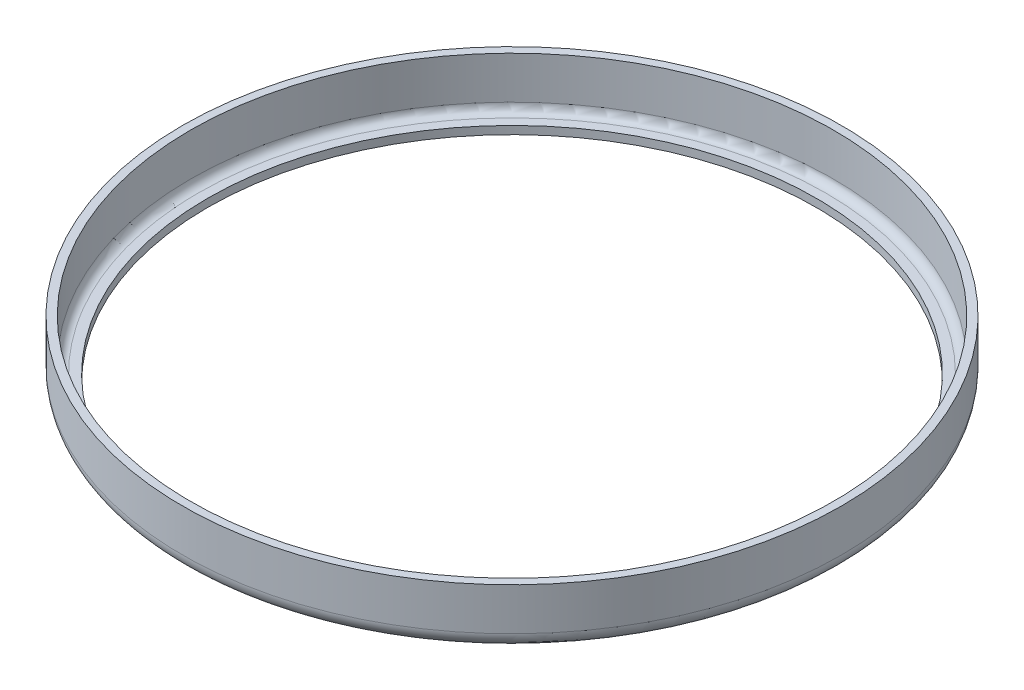
ISO-10303-21;
HEADER;
FILE_DESCRIPTION(('STEP AP214'),'2;1');
FILE_NAME('part.step','',(''),(''),'','','');
FILE_SCHEMA(('AUTOMOTIVE_DESIGN { 1 0 10303 214 1 1 1 1 }'));
ENDSEC;
DATA;
#1=APPLICATION_CONTEXT('core data for automotive mechanical design processes');
#2=APPLICATION_PROTOCOL_DEFINITION('international standard','automotive_design',2000,#1);
#3=PRODUCT_CONTEXT('',#1,'mechanical');
#4=PRODUCT('Part','Part','',(#3));
#5=PRODUCT_RELATED_PRODUCT_CATEGORY('part','',(#4));
#6=PRODUCT_DEFINITION_FORMATION('','',#4);
#7=PRODUCT_DEFINITION_CONTEXT('part definition',#1,'design');
#8=PRODUCT_DEFINITION('design','',#6,#7);
#9=PRODUCT_DEFINITION_SHAPE('','',#8);
#10=(LENGTH_UNIT() NAMED_UNIT(*) SI_UNIT(.MILLI.,.METRE.));
#11=(NAMED_UNIT(*) PLANE_ANGLE_UNIT() SI_UNIT($,.RADIAN.));
#12=(NAMED_UNIT(*) SI_UNIT($,.STERADIAN.) SOLID_ANGLE_UNIT());
#13=UNCERTAINTY_MEASURE_WITH_UNIT(LENGTH_MEASURE(1.E-05),#10,'distance_accuracy_value','');
#14=(GEOMETRIC_REPRESENTATION_CONTEXT(3) GLOBAL_UNCERTAINTY_ASSIGNED_CONTEXT((#13)) GLOBAL_UNIT_ASSIGNED_CONTEXT((#10,
#11,#12)) REPRESENTATION_CONTEXT('',''));
#15=CARTESIAN_POINT('',(0.,0.,0.));
#16=DIRECTION('',(0.,0.,1.));
#17=DIRECTION('',(1.,0.,0.));
#18=AXIS2_PLACEMENT_3D('',#15,#16,#17);
#19=CARTESIAN_POINT('',(0.,1.3,0.));
#20=DIRECTION('',(0.,1.,0.));
#21=DIRECTION('',(-1.00000000000002,0.,0.));
#22=AXIS2_PLACEMENT_3D('',#19,#20,#21);
#23=PLANE('',#22);
#24=CARTESIAN_POINT('',(0.,1.3,0.));
#25=DIRECTION('',(0.,1.,0.));
#26=DIRECTION('',(-1.00000000000002,0.,0.));
#27=AXIS2_PLACEMENT_3D('',#24,#25,#26);
#28=CIRCLE('',#27,49.5);
#29=CARTESIAN_POINT('',(-49.5000000000008,1.3,0.));
#30=VERTEX_POINT('',#29);
#31=EDGE_CURVE('E52',#30,#30,#28,.F.);
#32=ORIENTED_EDGE('',*,*,#31,.T.);
#33=EDGE_LOOP('',(#32));
#34=FACE_BOUND('',#33,.T.);
#35=CARTESIAN_POINT('',(0.,1.29999999999997,0.));
#36=DIRECTION('',(0.,-1.,0.));
#37=DIRECTION('',(-1.,0.,0.));
#38=AXIS2_PLACEMENT_3D('',#35,#36,#37);
#39=CIRCLE('',#38,51.0000000000011);
#40=CARTESIAN_POINT('',(50.9999999999999,1.3,-2.77555756156289E-13));
#41=VERTEX_POINT('',#40);
#42=CARTESIAN_POINT('',(-51.0000000000025,1.30000000000094,2.77555756156289E-13));
#43=VERTEX_POINT('',#42);
#44=EDGE_CURVE('E50',#41,#43,#39,.F.);
#45=ORIENTED_EDGE('',*,*,#44,.T.);
#46=CARTESIAN_POINT('',(51.0000000000011,1.29999999999997,1.40222590497045E-12));
#47=CARTESIAN_POINT('',(51.0000048953485,1.30000000000004,0.380232623312235));
#48=CARTESIAN_POINT('',(50.9957559119841,1.30000000001966,0.760465264725513));
#49=CARTESIAN_POINT('',(50.9787540292228,1.30000000009177,1.52081383078117));
#50=CARTESIAN_POINT('',(50.9659994881611,1.30000000014425,1.90092971871636));
#51=CARTESIAN_POINT('',(50.9319870512741,1.30000000027581,2.66085438904162));
#52=CARTESIAN_POINT('',(50.9107275146435,1.30000000035489,3.04066309799429));
#53=CARTESIAN_POINT('',(50.8597110518035,1.30000000053389,3.79978301740329));
#54=CARTESIAN_POINT('',(50.8299524866904,1.30000000063381,4.17909411771774));
#55=CARTESIAN_POINT('',(50.7619478933915,1.30000000084908,4.93702848590969));
#56=CARTESIAN_POINT('',(50.7237002289666,1.30000000096443,5.3156516069787));
#57=CARTESIAN_POINT('',(50.6387317130373,1.30000000120554,6.07201984611027));
#58=CARTESIAN_POINT('',(50.5920092287955,1.3000000013313,6.44976478075572));
#59=CARTESIAN_POINT('',(50.4901095934662,1.30000000158862,7.20418673328679));
#60=CARTESIAN_POINT('',(50.4349308139587,1.30000000172017,7.58086353122263));
#61=CARTESIAN_POINT('',(50.3161413768474,1.30000000198482,8.33295964982723));
#62=CARTESIAN_POINT('',(50.2525290959609,1.30000000211791,8.70837871410802));
#63=CARTESIAN_POINT('',(50.1168997001871,1.30000000238178,9.4577702537691));
#64=CARTESIAN_POINT('',(50.0448809679707,1.30000000251256,9.83174243643603));
#65=CARTESIAN_POINT('',(49.8924699631137,1.30000000276833,10.5780516458893));
#66=CARTESIAN_POINT('',(49.8120760799122,1.30000000289332,10.9503883437681));
#67=CARTESIAN_POINT('',(49.642950305587,1.30000000313444,11.6932386569323));
#68=CARTESIAN_POINT('',(49.5542168114822,1.30000000325056,12.0637519072653));
#69=CARTESIAN_POINT('',(49.3684515747471,1.30000000347122,12.8027681343645));
#70=CARTESIAN_POINT('',(49.271418237524,1.30000000357577,13.1712707103013));
#71=CARTESIAN_POINT('',(49.0690972864774,1.30000000377097,13.9060792286356));
#72=CARTESIAN_POINT('',(48.9638080872544,1.30000000386163,14.2723847345126));
#73=CARTESIAN_POINT('',(48.7450235801936,1.30000000402713,15.0026136787654));
#74=CARTESIAN_POINT('',(48.6315266969507,1.30000000410197,15.3665366451334));
#75=CARTESIAN_POINT('',(48.3963791672686,1.30000000423429,16.0918160971216));
#76=CARTESIAN_POINT('',(48.2747269562154,1.30000000429177,16.4531720754687));
#77=CARTESIAN_POINT('',(48.0233252729985,1.30000000438821,17.1731342532382));
#78=CARTESIAN_POINT('',(47.8935742478034,1.30000000442718,17.5317399103622));
#79=CARTESIAN_POINT('',(47.6260355721532,1.30000000448581,18.2460193565318));
#80=CARTESIAN_POINT('',(47.488246381036,1.30000000450549,18.6016925685115));
#81=CARTESIAN_POINT('',(47.2046961181249,1.30000000452516,19.3099263377674));
#82=CARTESIAN_POINT('',(47.0589335188196,1.30000000452516,19.6624862834858));
#83=CARTESIAN_POINT('',(46.7595052656973,1.30000000450549,20.3643141291315));
#84=CARTESIAN_POINT('',(46.6058380982945,1.30000000448581,20.7135813833022));
#85=CARTESIAN_POINT('',(46.2906735874608,1.30000000442717,21.4086459427654));
#86=CARTESIAN_POINT('',(46.1291747451384,1.30000000438821,21.7544425684132));
#87=CARTESIAN_POINT('',(45.7984237839038,1.30000000429176,22.442389547615));
#88=CARTESIAN_POINT('',(45.6291701815562,1.30000000423428,22.784539187964));
#89=CARTESIAN_POINT('',(45.282990587211,1.30000000410196,23.4650175444538));
#90=CARTESIAN_POINT('',(45.106063127989,1.30000000402711,23.8033455141745));
#91=CARTESIAN_POINT('',(44.7446206588054,1.30000000386161,24.4760076389348));
#92=CARTESIAN_POINT('',(44.5601041985775,1.30000000377095,24.8103410147014));
#93=CARTESIAN_POINT('',(44.1835724806725,1.30000000357575,25.4748429125298));
#94=CARTESIAN_POINT('',(43.9915557904262,1.3000000034712,25.8050106228448));
#95=CARTESIAN_POINT('',(43.6001162405041,1.30000000325054,26.4610120912091));
#96=CARTESIAN_POINT('',(43.4006919666873,1.30000000313442,26.7868450054338));
#97=CARTESIAN_POINT('',(42.9945337107306,1.3000000028933,27.4340098117425));
#98=CARTESIAN_POINT('',(42.7877983336001,1.30000000276831,27.7553408283363));
#99=CARTESIAN_POINT('',(42.3671181213993,1.30000000251254,28.3933368853951));
#100=CARTESIAN_POINT('',(42.1531719112016,1.30000000238176,28.7100010191329));
#101=CARTESIAN_POINT('',(41.7181740272877,1.30000000211789,29.3385005592009));
#102=CARTESIAN_POINT('',(41.4971209990111,1.30000000198479,29.650335028012));
#103=CARTESIAN_POINT('',(41.0480171680535,1.30000000172015,30.2690147734759));
#104=CARTESIAN_POINT('',(40.8199650320725,1.30000000158861,30.5758590822779));
#105=CARTESIAN_POINT('',(40.3569743261539,1.30000000133127,31.1844004199075));
#106=CARTESIAN_POINT('',(40.1220344448613,1.30000000120547,31.4860964510302));
#107=CARTESIAN_POINT('',(39.6453831651447,1.30000000096446,32.084185583385));
#108=CARTESIAN_POINT('',(39.4036704779801,1.30000000084925,32.3805776575469));
#109=CARTESIAN_POINT('',(38.9135921135735,1.3000000006336,32.9679058297777));
#110=CARTESIAN_POINT('',(38.6652251708807,1.30000000053317,33.2588408719308));
#111=CARTESIAN_POINT('',(38.1619600513173,1.30000000035559,33.835104306793));
#112=CARTESIAN_POINT('',(37.9070606328873,1.30000000027845,34.1204316152161));
#113=CARTESIAN_POINT('',(37.3908567064002,1.30000000014159,34.685332526614));
#114=CARTESIAN_POINT('',(37.129550981498,1.30000000008187,34.9649050176454));
#115=CARTESIAN_POINT('',(36.6006603728141,1.30000000002955,35.5181485867267));
#116=CARTESIAN_POINT('',(36.333074296843,1.30000000003695,35.7918185250712));
#117=CARTESIAN_POINT('',(35.7926789600628,1.29999999996311,36.3322115838581));
#118=CARTESIAN_POINT('',(35.5198890399216,1.29999999988215,36.5989540465125));
#119=CARTESIAN_POINT('',(34.9684120981634,1.30000000047372,37.1262667336197));
#120=CARTESIAN_POINT('',(34.6897251338749,1.30000000114624,37.3868370180235));
#121=CARTESIAN_POINT('',(34.1265925188402,1.30000000828845,37.9016721321774));
#122=CARTESIAN_POINT('',(33.8421469164047,1.3000000147581,38.155937014785));
#123=CARTESIAN_POINT('',(33.2676336433649,1.30000004037257,38.6580368453367));
#124=CARTESIAN_POINT('',(32.9775660124353,1.3000000595173,38.9058718386275));
#125=CARTESIAN_POINT('',(32.5749711243775,1.30000010590587,39.2421372724515));
#126=CARTESIAN_POINT('',(32.4647878435348,1.30000012060952,39.3333857931316));
#127=CARTESIAN_POINT('',(32.1699487210441,1.30000016101672,39.5754656337397));
#128=CARTESIAN_POINT('',(31.9846107209603,1.30000018751906,39.725467462671));
#129=CARTESIAN_POINT('',(31.5000063298851,1.3000002388895,40.1120409400492));
#130=CARTESIAN_POINT('',(31.199098398841,1.30000025323811,40.3465591494801));
#131=CARTESIAN_POINT('',(30.5920664737256,1.30000024176806,40.8087194195142));
#132=CARTESIAN_POINT('',(30.2859426424971,1.30000021595065,41.0363616941741));
#133=CARTESIAN_POINT('',(29.6686522730672,1.30000013805282,41.4846861110324));
#134=CARTESIAN_POINT('',(29.3574859112218,1.30000008597332,41.7053684958519));
#135=CARTESIAN_POINT('',(28.8086070691194,1.30000002406073,42.0852713355522));
#136=CARTESIAN_POINT('',(28.5719805079036,1.30000000692072,42.2460637359961));
#137=CARTESIAN_POINT('',(28.0815311708753,1.29999999265297,42.5736224797933));
#138=CARTESIAN_POINT('',(27.8275468780447,1.2999999968228,42.7401468249885));
#139=CARTESIAN_POINT('',(27.1247071788338,1.30000000948357,43.1920099422009));
#140=CARTESIAN_POINT('',(26.6727992749548,1.30000001886738,43.4726244578467));
#141=CARTESIAN_POINT('',(25.8373755655955,1.30000005827416,43.9734668032541));
#142=CARTESIAN_POINT('',(25.4551768835139,1.30000008455003,44.1958982290036));
#143=CARTESIAN_POINT('',(24.7293748413674,1.30000012114482,44.6057025717949));
#144=CARTESIAN_POINT('',(24.3863872415915,1.30000013295123,44.7941656777227));
#145=CARTESIAN_POINT('',(23.7468980640549,1.30000013816056,45.135987168959));
#146=CARTESIAN_POINT('',(23.4509767310036,1.30000013401424,45.2904326752651));
#147=CARTESIAN_POINT('',(22.8136674692762,1.30000011905215,45.6151172218906));
#148=CARTESIAN_POINT('',(22.471822825437,1.3000001073683,45.7844610383677));
#149=CARTESIAN_POINT('',(21.7844149524749,1.30000007856826,46.1154084448794));
#150=CARTESIAN_POINT('',(21.4388517703311,1.30000006145212,46.2770121325608));
#151=CARTESIAN_POINT('',(20.7441857596187,1.30000002940438,46.5924207569258));
#152=CARTESIAN_POINT('',(20.3950829802779,1.30000001447274,46.7462258018928));
#153=CARTESIAN_POINT('',(19.8688903310311,1.3000000026321,46.970967826308));
#154=CARTESIAN_POINT('',(19.6930692936607,1.3000000004447,47.0448877405391));
#155=CARTESIAN_POINT('',(19.4441896464357,1.29999999981657,47.1479461182615));
#156=CARTESIAN_POINT('',(19.3714573778846,1.29999999992952,47.1778742777366));
#157=CARTESIAN_POINT('',(18.9682018343383,1.30000000047577,47.3427343001144));
#158=CARTESIAN_POINT('',(18.6363429869361,1.30000000062823,47.4744176352255));
#159=CARTESIAN_POINT('',(17.9298893857376,1.30000001127747,47.7461864311565));
#160=CARTESIAN_POINT('',(17.5549509911732,1.30000002301503,47.8853801998632));
#161=CARTESIAN_POINT('',(17.0491026914806,1.30000004635177,48.0664377348198));
#162=CARTESIAN_POINT('',(16.9195800040389,1.30000005298323,48.1122084582501));
#163=CARTESIAN_POINT('',(16.4135202378347,1.30000007960455,48.2887371289975));
#164=CARTESIAN_POINT('',(16.0356117392949,1.30000010101756,48.4156009943435));
#165=CARTESIAN_POINT('',(15.3731091344207,1.30000012648924,48.6293594906973));
#166=CARTESIAN_POINT('',(15.0891492296098,1.30000013357146,48.7182327370473));
#167=CARTESIAN_POINT('',(14.3937588859848,1.30000013892277,48.9291855569189));
#168=CARTESIAN_POINT('',(13.9815044236223,1.30000013190768,49.048564126554));
#169=CARTESIAN_POINT('',(13.2000828802505,1.30000011059786,49.2641649693793));
#170=CARTESIAN_POINT('',(12.8312181643626,1.30000009719865,49.361486334691));
#171=CARTESIAN_POINT('',(12.0914026404635,1.3000000660953,49.5478203829303));
#172=CARTESIAN_POINT('',(11.7204518595005,1.30000004839122,49.6368331733261));
#173=CARTESIAN_POINT('',(10.8836498443692,1.30000001560985,49.8276350984483));
#174=CARTESIAN_POINT('',(10.4172547554717,1.30000000229537,49.9270561287481));
#175=CARTESIAN_POINT('',(9.80941312730119,1.29999999931184,50.0479271274064));
#176=CARTESIAN_POINT('',(9.66910720238875,1.29999999961401,50.0752272813089));
#177=CARTESIAN_POINT('',(9.1125796454198,1.30000000119024,50.1811095335644));
#178=CARTESIAN_POINT('',(8.69547640814187,1.30000000320776,50.2551421365725));
#179=CARTESIAN_POINT('',(8.01204804977799,1.30000001931491,50.3676790460062));
#180=CARTESIAN_POINT('',(7.7462280877952,1.30000002873203,50.4092917286635));
#181=CARTESIAN_POINT('',(7.23985127965435,1.30000005090437,50.4844613212104));
#182=CARTESIAN_POINT('',(6.99935230387317,1.30000006324576,50.5184080994232));
#183=CARTESIAN_POINT('',(6.3790239643244,1.30000009473286,50.6014398619712));
#184=CARTESIAN_POINT('',(5.99884738598328,1.30000011369705,50.6479616662361));
#185=CARTESIAN_POINT('',(5.41181983913989,1.30000013093692,50.713063947147));
#186=CARTESIAN_POINT('',(5.20530082657881,1.30000013470932,50.7346856589073));
#187=CARTESIAN_POINT('',(4.85629517127097,1.30000013648816,50.7690616518893));
#188=CARTESIAN_POINT('',(4.71387388834275,1.30000013592319,50.7824820960566));
#189=CARTESIAN_POINT('',(4.19146963898793,1.30000013159213,50.829487309259));
#190=CARTESIAN_POINT('',(3.81114897425673,1.3000001240603,50.8594019566097));
#191=CARTESIAN_POINT('',(3.04994010327919,1.30000010132011,50.9106638980837));
#192=CARTESIAN_POINT('',(2.66905190388895,1.30000008611184,50.9320112948747));
#193=CARTESIAN_POINT('',(1.90689541399295,1.30000005333875,50.9661458217759));
#194=CARTESIAN_POINT('',(1.52562712859177,1.30000003577397,50.9789330653389));
#195=CARTESIAN_POINT('',(0.762905692602223,1.30000001052994,50.995881077218));
#196=CARTESIAN_POINT('',(0.381452544779176,1.30000000285054,51.0000419708189));
#197=CARTESIAN_POINT('',(-0.38150742653925,1.29999999714899,50.9999580231448));
#198=CARTESIAN_POINT('',(-0.76301424986109,1.29999999912822,50.9957119724025));
#199=CARTESIAN_POINT('',(-1.52583357766029,1.30000000122791,50.978647330572));
#200=CARTESIAN_POINT('',(-1.90714608398969,1.3000000013484,50.9658288227771));
#201=CARTESIAN_POINT('',(-2.66938441111985,1.3000000080882,50.9316714338153));
#202=CARTESIAN_POINT('',(-3.05031023513617,1.30000001470746,50.9103326240928));
#203=CARTESIAN_POINT('',(-3.81159065259312,1.30000004042723,50.8591301196195));
#204=CARTESIAN_POINT('',(-4.19194525004413,1.30000005952766,50.8292664850023));
#205=CARTESIAN_POINT('',(-4.71439839531722,1.30000010590383,50.7823643103985));
#206=CARTESIAN_POINT('',(-4.85683218805623,1.30000012060907,50.7689754416173));
#207=CARTESIAN_POINT('',(-5.23649122711368,1.30000016101751,50.7316690320357));
#208=CARTESIAN_POINT('',(-5.47361229373592,1.30000018751753,50.7066825671874));
#209=CARTESIAN_POINT('',(-6.08962807102608,1.30000023888386,50.6373642184656));
#210=CARTESIAN_POINT('',(-6.46823152510258,1.30000025323185,50.5904196039386));
#211=CARTESIAN_POINT('',(-7.22426457588278,1.30000024176133,50.4879798795678));
#212=CARTESIAN_POINT('',(-7.60169420879945,1.30000021594407,50.4324850362267));
#213=CARTESIAN_POINT('',(-8.35519765050665,1.30000013804811,50.3130080646171));
#214=CARTESIAN_POINT('',(-8.73127150615274,1.30000008597032,50.2490262326035));
#215=CARTESIAN_POINT('',(-9.38801933299508,1.30000002405986,50.1295421606239));
#216=CARTESIAN_POINT('',(-9.66903697668177,1.30000000692048,50.0759193141923));
#217=CARTESIAN_POINT('',(-10.2474564899168,1.29999999265322,49.9607381834239));
#218=CARTESIAN_POINT('',(-10.5448014491295,1.29999999682288,49.8988945628621));
#219=CARTESIAN_POINT('',(-11.3612996357026,1.30000000948343,49.7214272966985));
#220=CARTESIAN_POINT('',(-11.8792707557543,1.30000001886735,49.6003046787099));
#221=CARTESIAN_POINT('',(-12.8241529428596,1.30000005827417,49.3637200783754));
#222=CARTESIAN_POINT('',(-13.251690838201,1.30000008455,49.2507476107575));
#223=CARTESIAN_POINT('',(-14.0546858157818,1.30000012114476,49.027303502203));
#224=CARTESIAN_POINT('',(-14.4304783675761,1.30000013295116,48.9180381419086));
#225=CARTESIAN_POINT('',(-15.1243699488252,1.3000001381605,48.7075552560267));
#226=CARTESIAN_POINT('',(-15.4428273950142,1.30000013401419,48.6075167395644));
#227=CARTESIAN_POINT('',(-16.123059740485,1.30000011905211,48.3864576835465));
#228=CARTESIAN_POINT('',(-16.4845245673058,1.30000010736828,48.264481178751));
#229=CARTESIAN_POINT('',(-17.2046104912108,1.30000007856824,48.0124255656782));
#230=CARTESIAN_POINT('',(-17.5632316241223,1.30000006145211,47.8823465596669));
#231=CARTESIAN_POINT('',(-18.2774622482238,1.30000002940438,47.6141710899448));
#232=CARTESIAN_POINT('',(-18.6330717811726,1.30000001447274,47.4760747376113));
#233=CARTESIAN_POINT('',(-19.1640627812363,1.30000000263211,47.2629169565538));
#234=CARTESIAN_POINT('',(-19.3406563016813,1.30000000044471,47.1908619813502));
#235=CARTESIAN_POINT('',(-19.5895140349334,1.29999999981658,47.0877507856156));
#236=CARTESIAN_POINT('',(-19.6621058890242,1.29999999992952,47.0574837227321));
#237=CARTESIAN_POINT('',(-20.0638242208958,1.30000000047577,46.8889126497365));
#238=CARTESIAN_POINT('',(-20.3915980349505,1.30000000062823,46.7473671912664));
#239=CARTESIAN_POINT('',(-21.083305756476,1.30000001127749,46.4399986060149));
#240=CARTESIAN_POINT('',(-21.4468521326749,1.30000002301505,46.2733019659564));
#241=CARTESIAN_POINT('',(-21.9325679405332,1.30000004635181,46.0436401976118));
#242=CARTESIAN_POINT('',(-22.0565190974985,1.30000005298327,45.9844186171593));
#243=CARTESIAN_POINT('',(-22.5391820050276,1.30000007960461,45.7514049474706));
#244=CARTESIAN_POINT('',(-22.8961099640658,1.30000010101762,45.5738895862782));
#245=CARTESIAN_POINT('',(-23.5157201334022,1.3000001264893,45.2565795830767));
#246=CARTESIAN_POINT('',(-23.7793529877535,1.30000013357153,45.1186324814478));
#247=CARTESIAN_POINT('',(-24.4202343896769,1.30000013892284,44.7760834207137));
#248=CARTESIAN_POINT('',(-24.7961557117681,1.30000013190774,44.5689888908889));
#249=CARTESIAN_POINT('',(-25.5011570021534,1.30000011059792,44.1688932365279));
#250=CARTESIAN_POINT('',(-25.8308003415128,1.3000000971987,43.9768830919131));
#251=CARTESIAN_POINT('',(-26.4856869844585,1.30000006609533,43.5855125871392));
#252=CARTESIAN_POINT('',(-26.8109303449103,1.30000004839124,43.3861523220977));
#253=CARTESIAN_POINT('',(-27.5375560595184,1.30000001560986,42.9293612776967));
#254=CARTESIAN_POINT('',(-27.9376484743388,1.30000000229538,42.6698714322652));
#255=CARTESIAN_POINT('',(-28.4529260906639,1.29999999931185,42.325531213697));
#256=CARTESIAN_POINT('',(-28.5714414619967,1.29999999961401,42.2456240827381));
#257=CARTESIAN_POINT('',(-29.0398359138821,1.30000000119024,41.9269697440301));
#258=CARTESIAN_POINT('',(-29.3871214042352,1.30000000320777,41.6843821679154));
#259=CARTESIAN_POINT('',(-29.9499538663151,1.3000000193149,41.2807009368667));
#260=CARTESIAN_POINT('',(-30.167341590511,1.30000002873201,41.1221624372917));
#261=CARTESIAN_POINT('',(-30.5785569548655,1.30000005090435,40.8172529205639));
#262=CARTESIAN_POINT('',(-30.7726193537732,1.30000006324575,40.6711985034726));
#263=CARTESIAN_POINT('',(-31.2699699935317,1.30000009473279,40.2912724956391));
#264=CARTESIAN_POINT('',(-31.5716913088246,1.30000011369688,40.0553429427825));
#265=CARTESIAN_POINT('',(-32.0328167915581,1.30000013093695,39.6862860139638));
#266=CARTESIAN_POINT('',(-32.1941367050667,1.30000013470949,39.5555438375388));
#267=CARTESIAN_POINT('',(-32.4652285192294,1.30000013648802,39.3330670100709));
#268=CARTESIAN_POINT('',(-32.5754252557044,1.30000013592278,39.2418496310445));
#269=CARTESIAN_POINT('',(-32.9780585778156,1.30000013159328,38.9056918090265));
#270=CARTESIAN_POINT('',(-33.2681388679498,1.30000012406752,38.6579175778894));
#271=CARTESIAN_POINT('',(-33.8426422073598,1.30000010131304,38.1559087226387));
#272=CARTESIAN_POINT('',(-34.127065324391,1.3000000860844,37.9016741759828));
#273=CARTESIAN_POINT('',(-34.6901291849648,1.30000005336633,37.3868870904464));
#274=CARTESIAN_POINT('',(-34.9687700050964,1.30000003587692,37.1263346353484));
#275=CARTESIAN_POINT('',(-35.5200755088993,1.30000001042706,36.5989850321123));
#276=CARTESIAN_POINT('',(-35.7927402793069,1.30000000246647,36.3321879747246));
#277=CARTESIAN_POINT('',(-36.2207340361145,1.29999999855241,35.9041361806055));
#278=CARTESIAN_POINT('',(-36.3780029530754,1.29999999899724,35.7448121098098));
#279=CARTESIAN_POINT('',(-36.9610659560972,1.3000000041957,35.146327179649));
#280=CARTESIAN_POINT('',(-37.3800893763434,1.30000001507845,34.7005091898935));
#281=CARTESIAN_POINT('',(-38.0222947630076,1.3000000546369,33.9921006023082));
#282=CARTESIAN_POINT('',(-38.2510682315732,1.30000007346351,33.7345415876913));
#283=CARTESIAN_POINT('',(-38.7183652848237,1.30000010846563,33.1975526903478));
#284=CARTESIAN_POINT('',(-38.9565268171867,1.30000012438191,32.9178066319479));
#285=CARTESIAN_POINT('',(-39.2694703967761,1.30000013378752,32.542029118343));
#286=CARTESIAN_POINT('',(-39.3469878039363,1.30000013515679,32.4482637417526));
#287=CARTESIAN_POINT('',(-39.5754188223161,1.30000013694968,32.1699227328954));
#288=CARTESIAN_POINT('',(-39.7253736584777,1.30000013520456,31.9845586944851));
#289=CARTESIAN_POINT('',(-40.1118477808155,1.30000012627567,31.4998995293347));
#290=CARTESIAN_POINT('',(-40.3463252740747,1.30000011645706,31.1989729944133));
#291=CARTESIAN_POINT('',(-40.8084434526149,1.30000009034258,30.5919248866736));
#292=CARTESIAN_POINT('',(-41.0360842219637,1.3000000740468,30.2858033778078));
#293=CARTESIAN_POINT('',(-41.4844338867227,1.3000000410144,29.6685283072828));
#294=CARTESIAN_POINT('',(-41.7051428761655,1.30000002427779,29.3573748139713));
#295=CARTESIAN_POINT('',(-42.0851642009325,1.30000000611424,28.8085588944137));
#296=CARTESIAN_POINT('',(-42.2460312532275,1.3000000019059,28.57197102061));
#297=CARTESIAN_POINT('',(-42.5835071270608,1.29999999785852,28.0667963261155));
#298=CARTESIAN_POINT('',(-42.7596047458369,1.29999999862366,27.797868035987));
#299=CARTESIAN_POINT('',(-43.2107132853047,1.30000000715777,27.0945408607234));
#300=CARTESIAN_POINT('',(-43.4817446631004,1.30000001884992,26.6575792184248));
#301=CARTESIAN_POINT('',(-43.9734688018581,1.30000005890652,25.8373784364392));
#302=CARTESIAN_POINT('',(-44.1958983953838,1.30000008470897,25.4551781851422));
#303=CARTESIAN_POINT('',(-44.6057017142095,1.30000012100414,24.7293749476856));
#304=CARTESIAN_POINT('',(-44.7941653752935,1.30000013291615,24.3863874385604));
#305=CARTESIAN_POINT('',(-45.1359872728922,1.30000013819049,23.7468981842183));
#306=CARTESIAN_POINT('',(-45.2904327049365,1.30000013402279,23.4509767651297));
#307=CARTESIAN_POINT('',(-45.6151171883579,1.3000001190425,22.8136674301199));
#308=CARTESIAN_POINT('',(-45.7844610295951,1.30000010736578,22.4718228149022));
#309=CARTESIAN_POINT('',(-46.1154084541644,1.30000007857093,21.7844149628094));
#310=CARTESIAN_POINT('',(-46.2770121351438,1.30000006145287,21.4388517729141));
#311=CARTESIAN_POINT('',(-46.5924207548575,1.30000002940374,20.7441857567338));
#312=CARTESIAN_POINT('',(-46.7462258018753,1.30000001447264,20.3950829796766));
#313=CARTESIAN_POINT('',(-46.9709678265842,1.30000000263217,19.8688903310003));
#314=CARTESIAN_POINT('',(-47.0448877404491,1.30000000044472,19.6930692933452));
#315=CARTESIAN_POINT('',(-47.1479457512954,1.29999999981658,19.444190532856));
#316=CARTESIAN_POINT('',(-47.1778735477405,1.29999999992952,19.3714591526763));
#317=CARTESIAN_POINT('',(-47.3427331416895,1.30000000047577,18.9682047222417));
#318=CARTESIAN_POINT('',(-47.474416410696,1.30000000062823,18.6363460990542));
#319=CARTESIAN_POINT('',(-47.7461855807083,1.300000011277,17.9298916648955));
#320=CARTESIAN_POINT('',(-47.8853797599094,1.30000002301406,17.554952201633));
#321=CARTESIAN_POINT('',(-48.0664375171176,1.30000004634971,17.0491032780795));
#322=CARTESIAN_POINT('',(-48.1122080814913,1.30000005298081,16.9195810457646));
#323=CARTESIAN_POINT('',(-48.2887364526699,1.30000007960068,16.4135221812654));
#324=CARTESIAN_POINT('',(-48.4156001841973,1.30000010101238,16.0356141315609));
#325=CARTESIAN_POINT('',(-48.6293588595075,1.30000012648201,15.3731110945893));
#326=CARTESIAN_POINT('',(-48.7182323924401,1.30000013356341,15.0891503005981));
#327=CARTESIAN_POINT('',(-48.9291854881292,1.3000001389134,14.3937590482605));
#328=CARTESIAN_POINT('',(-49.0485640626779,1.30000013189816,13.9815045711791));
#329=CARTESIAN_POINT('',(-49.2641649156781,1.30000011058918,13.2000829997984));
#330=CARTESIAN_POINT('',(-49.3614862861548,1.30000009719082,12.8312182706003));
#331=CARTESIAN_POINT('',(-49.5478203455844,1.30000006608971,12.0914027198304));
#332=CARTESIAN_POINT('',(-49.6368331419969,1.30000004838701,11.7204519253047));
#333=CARTESIAN_POINT('',(-49.827635080948,1.30000001560845,10.8836498791108));
#334=CARTESIAN_POINT('',(-49.9270561190833,1.30000000229529,10.417254772718));
#335=CARTESIAN_POINT('',(-50.0479275869505,1.29999999931186,9.80941082539178));
#336=CARTESIAN_POINT('',(-50.0752281816615,1.29999999961396,9.66910259500197));
#337=CARTESIAN_POINT('',(-50.181110701691,1.30000000119049,9.11257326964172));
#338=CARTESIAN_POINT('',(-50.255143167347,1.30000000320948,8.69547057703493));
#339=CARTESIAN_POINT('',(-50.3676796782432,1.30000001932265,8.0120443126666));
#340=CARTESIAN_POINT('',(-50.4092921101346,1.30000002874296,7.74622590150678));
#341=CARTESIAN_POINT('',(-50.4844617727303,1.30000005092306,7.23984866650016));
#342=CARTESIAN_POINT('',(-50.5184088190392,1.30000006326892,6.9993477051873));
#343=CARTESIAN_POINT('',(-50.6014408111623,1.30000009476746,6.37901720392301));
#344=CARTESIAN_POINT('',(-50.6479626066678,1.30000011373867,5.99884045293401));
#345=CARTESIAN_POINT('',(-50.7130645807728,1.30000013098863,5.41181481875068));
#346=CARTESIAN_POINT('',(-50.7346860448912,1.30000013476446,5.20529789417814));
#347=CARTESIAN_POINT('',(-50.769061872948,1.30000013654444,4.85629435108854));
#348=CARTESIAN_POINT('',(-50.7824823524783,1.3000001359786,4.71387309019265));
#349=CARTESIAN_POINT('',(-50.8294873518447,1.30000013165784,4.19146892667479));
#350=CARTESIAN_POINT('',(-50.8594011777704,1.3000001241596,3.81114833178378));
#351=CARTESIAN_POINT('',(-50.9106650138495,1.30000010132772,3.04993956412074));
#352=CARTESIAN_POINT('',(-50.9320151266778,1.30000008599418,2.66905139820857));
#353=CARTESIAN_POINT('',(-50.9661422406726,1.30000005352663,1.90689511714696));
#354=CARTESIAN_POINT('',(-50.9789193555153,1.30000003639265,1.52562700710263));
#355=CARTESIAN_POINT('',(-50.9958949248738,1.3000000099356,0.762905405561951));
#356=CARTESIAN_POINT('',(-51.0000935040369,1.30000000061242,0.381451916839737));
#357=CARTESIAN_POINT('',(-51.0000000000011,1.29999999999997,-1.38465593144362E-12));
#358=B_SPLINE_CURVE_WITH_KNOTS('',3,(#46,#47,#48,#49,#50,#51,#52,#53,#54,#55,#56,#57,#58,#59,
#60,#61,#62,#63,#64,#65,#66,#67,#68,#69,#70,#71,#72,#73,#74,#75,#76,#77,#78,#79,#80,#81,#82,#83,
#84,#85,#86,#87,#88,#89,#90,#91,#92,#93,#94,#95,#96,#97,#98,#99,#100,#101,#102,#103,#104,#105,
#106,#107,#108,#109,#110,#111,#112,#113,#114,#115,#116,#117,#118,#119,#120,#121,#122,#123,#124,
#125,#126,#127,#128,#129,#130,#131,#132,#133,#134,#135,#136,#137,#138,#139,#140,#141,#142,#143,
#144,#145,#146,#147,#148,#149,#150,#151,#152,#153,#154,#155,#156,#157,#158,#159,#160,#161,#162,
#163,#164,#165,#166,#167,#168,#169,#170,#171,#172,#173,#174,#175,#176,#177,#178,#179,#180,#181,
#182,#183,#184,#185,#186,#187,#188,#189,#190,#191,#192,#193,#194,#195,#196,#197,#198,#199,#200,
#201,#202,#203,#204,#205,#206,#207,#208,#209,#210,#211,#212,#213,#214,#215,#216,#217,#218,#219,
#220,#221,#222,#223,#224,#225,#226,#227,#228,#229,#230,#231,#232,#233,#234,#235,#236,#237,#238,
#239,#240,#241,#242,#243,#244,#245,#246,#247,#248,#249,#250,#251,#252,#253,#254,#255,#256,#257,
#258,#259,#260,#261,#262,#263,#264,#265,#266,#267,#268,#269,#270,#271,#272,#273,#274,#275,#276,
#277,#278,#279,#280,#281,#282,#283,#284,#285,#286,#287,#288,#289,#290,#291,#292,#293,#294,#295,
#296,#297,#298,#299,#300,#301,#302,#303,#304,#305,#306,#307,#308,#309,#310,#311,#312,#313,#314,
#315,#316,#317,#318,#319,#320,#321,#322,#323,#324,#325,#326,#327,#328,#329,#330,#331,#332,#333,
#334,#335,#336,#337,#338,#339,#340,#341,#342,#343,#344,#345,#346,#347,#348,#349,#350,#351,#352,
#353,#354,#355,#356,#357),.UNSPECIFIED.,.F.,.F.,(4,2,2,2,2,2,2,2,2,2,2,2,2,2,2,2,2,2,2,2,2,2,2,
2,2,2,2,2,2,2,2,2,2,2,2,2,2,2,2,2,2,2,2,2,2,2,2,2,2,2,2,2,2,2,2,2,2,2,2,2,2,2,2,2,2,2,2,2,2,2,2,
2,2,2,2,2,2,2,2,2,2,2,2,2,2,2,2,2,2,2,2,2,2,2,2,2,2,2,2,2,2,2,2,2,2,2,2,2,2,2,2,2,2,2,2,2,2,2,2,
2,2,2,2,2,2,2,2,2,2,2,2,2,2,2,2,2,2,2,2,2,2,2,2,2,2,2,2,2,2,2,2,2,2,2,2,4),(0.,1.14067404651072,
2.28156831920603,3.42268280233661,4.56401748014393,5.70557233686028,6.84734735670888,
7.98934252390364,9.13155782264948,10.273993237142,11.4166487515677,12.5595243501039,
13.7026200169188,14.8459357361714,15.9894714920115,17.1332272685799,18.2772030500079,
19.4213988204181,20.5658145639234,21.710450264628,22.8553059066268,24.0003814740053,
25.1456769508402,26.2911923211987,27.4369275691392,28.5828826787105,29.7290576339526,
30.8754524188963,32.0220670175629,33.1689014139649,34.3159555921055,35.4632295359788,
36.6107232295695,37.7584366568535,38.9063698017973,40.0545226483583,41.1990202240636,
42.343506678561,43.4879835356613,44.6324523191262,45.0616340406523,45.7769124288952,
46.9213170598294,48.0656860271518,49.2100150576619,50.0682410460158,50.9793248609755,
52.5748684148488,53.9013631496913,55.0753205471022,56.0766614883761,57.2210332470194,
58.3653905648657,59.5097319890533,60.0819053349244,60.3178522536411,61.3888611944527,
62.5885621780156,63.0006769654847,64.1964464363154,65.0890378698811,66.3764608656476,
67.520829150303,68.6651826309413,70.0955844853581,70.5243954874368,71.7951035041389,
72.6022463329718,73.3308731729975,74.4797981785878,75.1027276098186,75.5318805384725,
76.6762589728496,77.8206236928769,78.96497324567,80.1093061783896,81.2538037528272,
82.3982902070449,83.5427670647469,84.6872358495883,85.1164175718114,85.8316959589289,
86.9761005886463,88.1204695555551,89.2647985865589,90.1230245759385,91.0341097717098,
92.6296519442351,93.9561461997219,95.1301040762843,96.1314450177269,97.2758167765653,
98.4201740946093,99.5645155189967,100.136688864969,100.372635683706,101.44364460204,
102.643345707412,103.055460486353,104.251229948921,105.14382139904,106.431244395018,
107.575612679853,108.719966160665,110.150368015288,110.579178931857,111.849886973516,
112.65702986321,113.385656495527,114.534581486962,115.157511140167,115.586664068787,
116.731042503068,117.875407222987,119.019756775659,120.164089708242,120.835690227897,
122.670690467011,123.704110968794,124.806190995561,125.171166178599,125.886416336006,
127.030791478043,128.175152542506,129.319498076521,130.177754078146,131.142066436054,
132.684385560128,134.010879145104,135.184837692353,136.18617863369,137.330550392395,
138.474907710288,139.619249134506,140.191422480387,140.427366520093,141.498374762694,
142.69807917934,143.11019252049,144.305960587584,145.198554823284,146.485977865659,
147.630346192894,148.774699717284,150.205101628174,150.633919671812,151.904626008546,
152.71176412491,153.440396975532,154.589322486873,155.21224561715,155.641398478057,
156.785776727464,157.930141255901,159.074490610002,160.218823336445),.UNSPECIFIED.);
#359=EDGE_CURVE('E45',#43,#41,#358,.F.);
#360=ORIENTED_EDGE('',*,*,#359,.T.);
#361=EDGE_LOOP('',(#45,#360));
#362=FACE_BOUND('',#361,.T.);
#363=ADVANCED_FACE('F16',(#34,#362),#23,.T.);
#364=CARTESIAN_POINT('',(0.,-0.475000000000003,0.));
#365=DIRECTION('',(0.,1.,0.));
#366=DIRECTION('',(-1.00000000000002,0.,0.));
#367=AXIS2_PLACEMENT_3D('',#364,#365,#366);
#368=CYLINDRICAL_SURFACE('',#367,49.5);
#369=ORIENTED_EDGE('',*,*,#31,.F.);
#370=EDGE_LOOP('',(#369));
#371=FACE_BOUND('',#370,.T.);
#372=CARTESIAN_POINT('',(0.,0.,0.));
#373=DIRECTION('',(0.,1.,0.));
#374=DIRECTION('',(-1.00000000000002,0.,0.));
#375=AXIS2_PLACEMENT_3D('',#372,#373,#374);
#376=CIRCLE('',#375,49.5);
#377=CARTESIAN_POINT('',(-49.5000000000008,0.,0.));
#378=VERTEX_POINT('',#377);
#379=EDGE_CURVE('E55',#378,#378,#376,.F.);
#380=ORIENTED_EDGE('',*,*,#379,.T.);
#381=EDGE_LOOP('',(#380));
#382=FACE_BOUND('',#381,.T.);
#383=ADVANCED_FACE('F88',(#371,#382),#368,.F.);
#384=CARTESIAN_POINT('',(0.,2.60000000000002,0.));
#385=DIRECTION('',(0.,1.,0.));
#386=DIRECTION('',(0.,0.,1.));
#387=AXIS2_PLACEMENT_3D('',#384,#385,#386);
#388=TOROIDAL_SURFACE('',#387,51.0000000000011,1.3);
#389=CARTESIAN_POINT('',(0.,2.59999999999999,0.));
#390=DIRECTION('',(0.,1.,0.));
#391=DIRECTION('',(-1.00000000000002,0.,0.));
#392=AXIS2_PLACEMENT_3D('',#389,#390,#391);
#393=CIRCLE('',#392,52.3);
#394=CARTESIAN_POINT('',(-52.3000000000008,2.59999999999999,-1.01658525347714E-13));
#395=VERTEX_POINT('',#394);
#396=EDGE_CURVE('E58',#395,#395,#393,.T.);
#397=ORIENTED_EDGE('',*,*,#396,.T.);
#398=EDGE_LOOP('',(#397));
#399=FACE_BOUND('',#398,.T.);
#400=ORIENTED_EDGE('',*,*,#44,.F.);
#401=ORIENTED_EDGE('',*,*,#359,.F.);
#402=EDGE_LOOP('',(#400,#401));
#403=FACE_BOUND('',#402,.T.);
#404=ADVANCED_FACE('F49',(#399,#403),#388,.F.);
#405=CARTESIAN_POINT('',(0.,0.,0.));
#406=DIRECTION('',(0.,1.,0.));
#407=DIRECTION('',(-1.00000000000002,0.,0.));
#408=AXIS2_PLACEMENT_3D('',#405,#406,#407);
#409=PLANE('',#408);
#410=ORIENTED_EDGE('',*,*,#379,.F.);
#411=EDGE_LOOP('',(#410));
#412=FACE_BOUND('',#411,.T.);
#413=CARTESIAN_POINT('',(0.,7.29017540779253E-13,0.));
#414=DIRECTION('',(0.,1.,0.));
#415=DIRECTION('',(1.,0.,0.));
#416=AXIS2_PLACEMENT_3D('',#413,#414,#415);
#417=CIRCLE('',#416,51.0000000000008);
#418=CARTESIAN_POINT('',(50.9999999999999,0.,-2.77555756156289E-13));
#419=VERTEX_POINT('',#418);
#420=CARTESIAN_POINT('',(-51.0000000000025,9.43689570931383E-13,2.77555756156289E-13));
#421=VERTEX_POINT('',#420);
#422=EDGE_CURVE('E36',#419,#421,#417,.T.);
#423=ORIENTED_EDGE('',*,*,#422,.F.);
#424=CARTESIAN_POINT('',(0.,7.29017540779253E-13,0.));
#425=DIRECTION('',(0.,1.,0.));
#426=DIRECTION('',(-1.,0.,0.));
#427=AXIS2_PLACEMENT_3D('',#424,#425,#426);
#428=CIRCLE('',#427,51.0000000000008);
#429=EDGE_CURVE('E126',#421,#419,#428,.T.);
#430=ORIENTED_EDGE('',*,*,#429,.F.);
#431=EDGE_LOOP('',(#423,#430));
#432=FACE_BOUND('',#431,.T.);
#433=ADVANCED_FACE('F87',(#412,#432),#409,.F.);
#434=CARTESIAN_POINT('',(0.,-0.475000000000003,0.));
#435=DIRECTION('',(0.,1.,0.));
#436=DIRECTION('',(-1.00000000000002,0.,0.));
#437=AXIS2_PLACEMENT_3D('',#434,#435,#436);
#438=CYLINDRICAL_SURFACE('',#437,52.3);
#439=CARTESIAN_POINT('',(0.,9.50000000000001,0.));
#440=DIRECTION('',(0.,1.,0.));
#441=DIRECTION('',(-1.00000000000002,0.,0.));
#442=AXIS2_PLACEMENT_3D('',#439,#440,#441);
#443=CIRCLE('',#442,52.3);
#444=CARTESIAN_POINT('',(-52.3000000000008,9.50000000000001,-1.01658525347714E-13));
#445=VERTEX_POINT('',#444);
#446=EDGE_CURVE('E135',#445,#445,#443,.F.);
#447=ORIENTED_EDGE('',*,*,#446,.F.);
#448=EDGE_LOOP('',(#447));
#449=FACE_BOUND('',#448,.T.);
#450=ORIENTED_EDGE('',*,*,#396,.F.);
#451=EDGE_LOOP('',(#450));
#452=FACE_BOUND('',#451,.T.);
#453=ADVANCED_FACE('F111',(#449,#452),#438,.F.);
#454=CARTESIAN_POINT('',(0.,2.60000000000082,0.));
#455=DIRECTION('',(0.,1.,0.));
#456=DIRECTION('',(0.,0.,-1.));
#457=AXIS2_PLACEMENT_3D('',#454,#455,#456);
#458=TOROIDAL_SURFACE('',#457,51.0000000000008,2.6);
#459=CARTESIAN_POINT('',(0.,2.59999999999999,0.));
#460=DIRECTION('',(0.,1.,0.));
#461=DIRECTION('',(-1.00000000000002,0.,0.));
#462=AXIS2_PLACEMENT_3D('',#459,#460,#461);
#463=CIRCLE('',#462,53.6);
#464=CARTESIAN_POINT('',(-53.6000000000008,2.59999999999999,-1.04185410298996E-13));
#465=VERTEX_POINT('',#464);
#466=EDGE_CURVE('E28',#465,#465,#463,.T.);
#467=ORIENTED_EDGE('',*,*,#466,.F.);
#468=EDGE_LOOP('',(#467));
#469=FACE_BOUND('',#468,.T.);
#470=ORIENTED_EDGE('',*,*,#429,.T.);
#471=ORIENTED_EDGE('',*,*,#422,.T.);
#472=EDGE_LOOP('',(#470,#471));
#473=FACE_BOUND('',#472,.T.);
#474=ADVANCED_FACE('F100',(#469,#473),#458,.T.);
#475=CARTESIAN_POINT('',(0.,9.50000000000001,0.));
#476=DIRECTION('',(0.,1.,0.));
#477=DIRECTION('',(-1.00000000000002,0.,0.));
#478=AXIS2_PLACEMENT_3D('',#475,#476,#477);
#479=PLANE('',#478);
#480=ORIENTED_EDGE('',*,*,#446,.T.);
#481=EDGE_LOOP('',(#480));
#482=FACE_BOUND('',#481,.T.);
#483=CARTESIAN_POINT('',(0.,9.50000000000001,0.));
#484=DIRECTION('',(0.,1.,0.));
#485=DIRECTION('',(-1.00000000000002,0.,0.));
#486=AXIS2_PLACEMENT_3D('',#483,#484,#485);
#487=CIRCLE('',#486,53.6);
#488=CARTESIAN_POINT('',(-53.6000000000008,9.50000000000001,-1.04185410298996E-13));
#489=VERTEX_POINT('',#488);
#490=EDGE_CURVE('E11',#489,#489,#487,.F.);
#491=ORIENTED_EDGE('',*,*,#490,.F.);
#492=EDGE_LOOP('',(#491));
#493=FACE_BOUND('',#492,.T.);
#494=ADVANCED_FACE('F110',(#482,#493),#479,.T.);
#495=CARTESIAN_POINT('',(0.,-0.475000000000003,0.));
#496=DIRECTION('',(0.,1.,0.));
#497=DIRECTION('',(-1.00000000000002,0.,0.));
#498=AXIS2_PLACEMENT_3D('',#495,#496,#497);
#499=CYLINDRICAL_SURFACE('',#498,53.6);
#500=ORIENTED_EDGE('',*,*,#490,.T.);
#501=EDGE_LOOP('',(#500));
#502=FACE_BOUND('',#501,.T.);
#503=ORIENTED_EDGE('',*,*,#466,.T.);
#504=EDGE_LOOP('',(#503));
#505=FACE_BOUND('',#504,.T.);
#506=ADVANCED_FACE('F154',(#502,#505),#499,.T.);
#507=CLOSED_SHELL('',(#363,#383,#404,#433,#453,#474,#494,#506));
#508=MANIFOLD_SOLID_BREP('B1',#507);
#509=ADVANCED_BREP_SHAPE_REPRESENTATION('',(#18,#508),#14);
#510=SHAPE_DEFINITION_REPRESENTATION(#9,#509);
ENDSEC;
END-ISO-10303-21;
